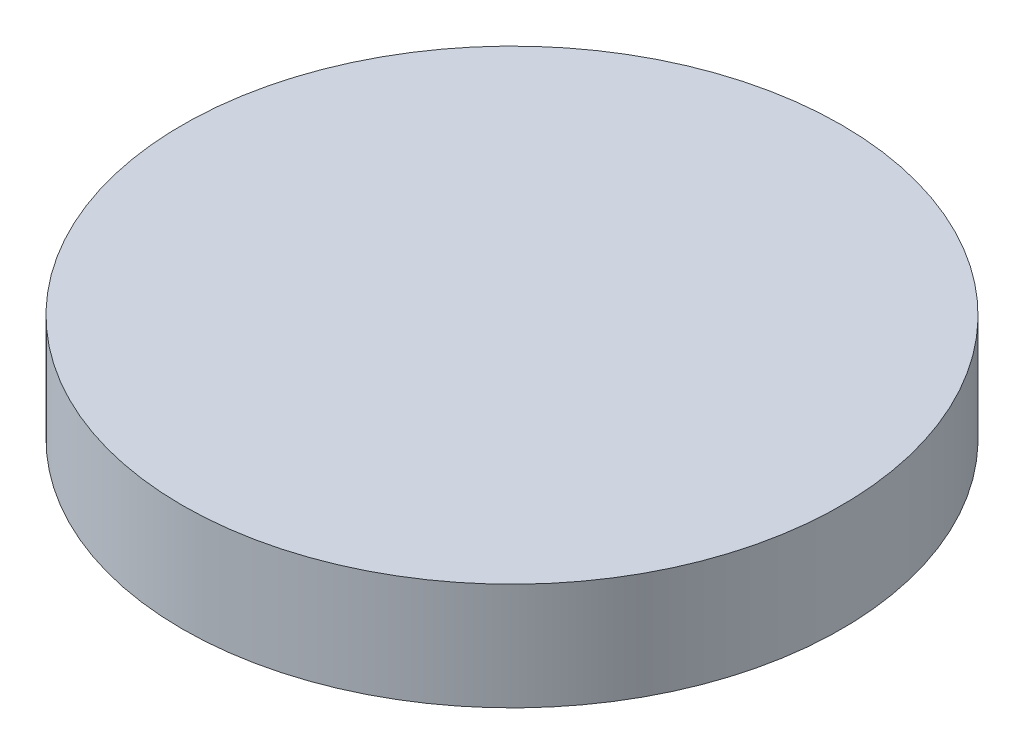
ISO-10303-21;
HEADER;
FILE_DESCRIPTION(('STEP AP214'),'2;1');
FILE_NAME('part.step','',(''),(''),'','','');
FILE_SCHEMA(('AUTOMOTIVE_DESIGN { 1 0 10303 214 1 1 1 1 }'));
ENDSEC;
DATA;
#1=APPLICATION_CONTEXT('core data for automotive mechanical design processes');
#2=APPLICATION_PROTOCOL_DEFINITION('international standard','automotive_design',2000,#1);
#3=PRODUCT_CONTEXT('',#1,'mechanical');
#4=PRODUCT('Part','Part','',(#3));
#5=PRODUCT_RELATED_PRODUCT_CATEGORY('part','',(#4));
#6=PRODUCT_DEFINITION_FORMATION('','',#4);
#7=PRODUCT_DEFINITION_CONTEXT('part definition',#1,'design');
#8=PRODUCT_DEFINITION('design','',#6,#7);
#9=PRODUCT_DEFINITION_SHAPE('','',#8);
#10=(LENGTH_UNIT() NAMED_UNIT(*) SI_UNIT(.MILLI.,.METRE.));
#11=(NAMED_UNIT(*) PLANE_ANGLE_UNIT() SI_UNIT($,.RADIAN.));
#12=(NAMED_UNIT(*) SI_UNIT($,.STERADIAN.) SOLID_ANGLE_UNIT());
#13=UNCERTAINTY_MEASURE_WITH_UNIT(LENGTH_MEASURE(1.E-05),#10,'distance_accuracy_value','');
#14=(GEOMETRIC_REPRESENTATION_CONTEXT(3) GLOBAL_UNCERTAINTY_ASSIGNED_CONTEXT((#13)) GLOBAL_UNIT_ASSIGNED_CONTEXT((#10,
#11,#12)) REPRESENTATION_CONTEXT('',''));
#15=CARTESIAN_POINT('',(0.,0.,0.));
#16=DIRECTION('',(0.,0.,1.));
#17=DIRECTION('',(1.,0.,0.));
#18=AXIS2_PLACEMENT_3D('',#15,#16,#17);
#19=CARTESIAN_POINT('',(0.,13.,0.));
#20=DIRECTION('',(0.,-1.,0.));
#21=DIRECTION('',(0.,0.,-1.));
#22=AXIS2_PLACEMENT_3D('',#19,#20,#21);
#23=CYLINDRICAL_SURFACE('',#22,40.);
#24=CARTESIAN_POINT('',(0.,13.,0.));
#25=DIRECTION('',(0.,1.,0.));
#26=DIRECTION('',(0.,0.,1.));
#27=AXIS2_PLACEMENT_3D('',#24,#25,#26);
#28=CIRCLE('',#27,40.);
#29=CARTESIAN_POINT('',(0.,13.,40.));
#30=VERTEX_POINT('',#29);
#31=EDGE_CURVE('E10',#30,#30,#28,.T.);
#32=ORIENTED_EDGE('',*,*,#31,.F.);
#33=EDGE_LOOP('',(#32));
#34=FACE_BOUND('',#33,.T.);
#35=CARTESIAN_POINT('',(0.,0.,0.));
#36=DIRECTION('',(0.,1.,0.));
#37=DIRECTION('',(0.,0.,1.));
#38=AXIS2_PLACEMENT_3D('',#35,#36,#37);
#39=CIRCLE('',#38,40.);
#40=CARTESIAN_POINT('',(0.,0.,40.));
#41=VERTEX_POINT('',#40);
#42=EDGE_CURVE('E44',#41,#41,#39,.T.);
#43=ORIENTED_EDGE('',*,*,#42,.T.);
#44=EDGE_LOOP('',(#43));
#45=FACE_BOUND('',#44,.T.);
#46=ADVANCED_FACE('F41',(#34,#45),#23,.T.);
#47=CARTESIAN_POINT('',(0.,13.,0.));
#48=DIRECTION('',(0.,1.,0.));
#49=DIRECTION('',(0.,0.,1.));
#50=AXIS2_PLACEMENT_3D('',#47,#48,#49);
#51=PLANE('',#50);
#52=ORIENTED_EDGE('',*,*,#31,.T.);
#53=EDGE_LOOP('',(#52));
#54=FACE_BOUND('',#53,.T.);
#55=ADVANCED_FACE('F58',(#54),#51,.T.);
#56=CARTESIAN_POINT('',(0.,0.,0.));
#57=DIRECTION('',(0.,1.,0.));
#58=DIRECTION('',(0.,0.,1.));
#59=AXIS2_PLACEMENT_3D('',#56,#57,#58);
#60=PLANE('',#59);
#61=ORIENTED_EDGE('',*,*,#42,.F.);
#62=EDGE_LOOP('',(#61));
#63=FACE_BOUND('',#62,.T.);
#64=ADVANCED_FACE('F56',(#63),#60,.F.);
#65=CLOSED_SHELL('',(#46,#55,#64));
#66=MANIFOLD_SOLID_BREP('B2',#65);
#67=ADVANCED_BREP_SHAPE_REPRESENTATION('',(#18,#66),#14);
#68=SHAPE_DEFINITION_REPRESENTATION(#9,#67);
ENDSEC;
END-ISO-10303-21;
